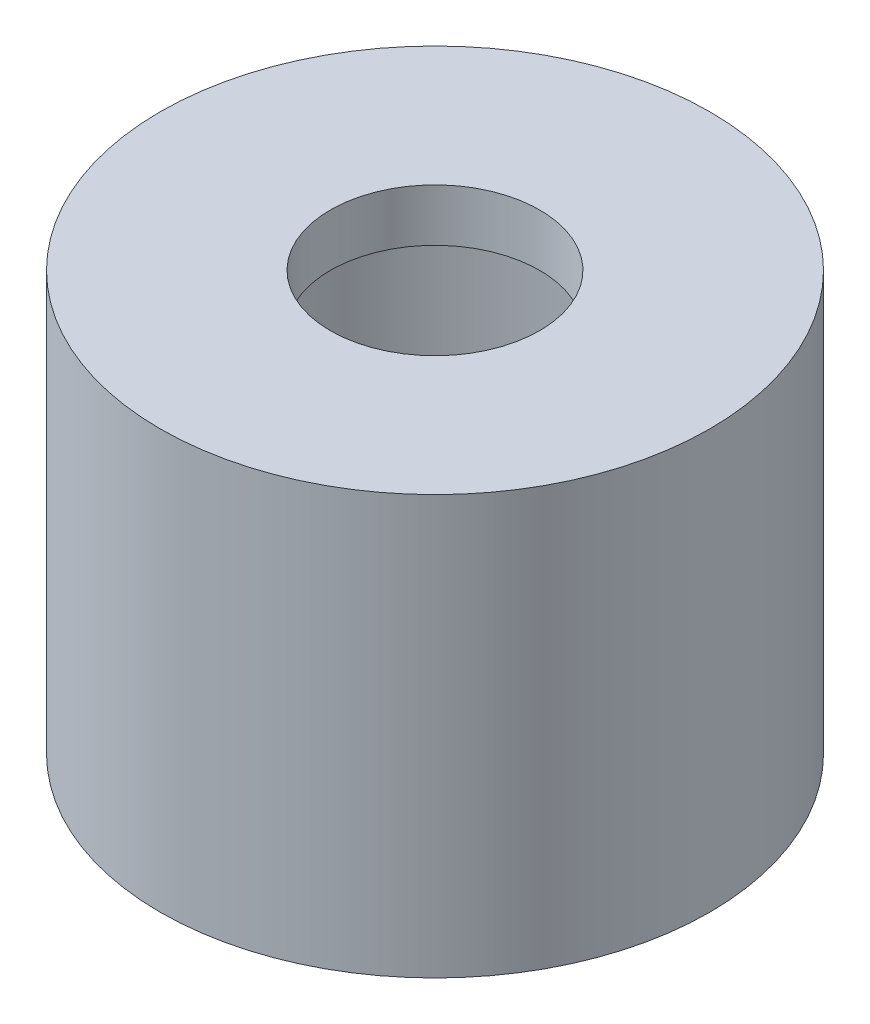
ISO-10303-21;
HEADER;
FILE_DESCRIPTION(('STEP AP214'),'2;1');
FILE_NAME('part.step','',(''),(''),'','','');
FILE_SCHEMA(('AUTOMOTIVE_DESIGN { 1 0 10303 214 1 1 1 1 }'));
ENDSEC;
DATA;
#1=APPLICATION_CONTEXT('core data for automotive mechanical design processes');
#2=APPLICATION_PROTOCOL_DEFINITION('international standard','automotive_design',2000,#1);
#3=PRODUCT_CONTEXT('',#1,'mechanical');
#4=PRODUCT('Part','Part','',(#3));
#5=PRODUCT_RELATED_PRODUCT_CATEGORY('part','',(#4));
#6=PRODUCT_DEFINITION_FORMATION('','',#4);
#7=PRODUCT_DEFINITION_CONTEXT('part definition',#1,'design');
#8=PRODUCT_DEFINITION('design','',#6,#7);
#9=PRODUCT_DEFINITION_SHAPE('','',#8);
#10=(LENGTH_UNIT() NAMED_UNIT(*) SI_UNIT(.MILLI.,.METRE.));
#11=(NAMED_UNIT(*) PLANE_ANGLE_UNIT() SI_UNIT($,.RADIAN.));
#12=(NAMED_UNIT(*) SI_UNIT($,.STERADIAN.) SOLID_ANGLE_UNIT());
#13=UNCERTAINTY_MEASURE_WITH_UNIT(LENGTH_MEASURE(1.E-05),#10,'distance_accuracy_value','');
#14=(GEOMETRIC_REPRESENTATION_CONTEXT(3) GLOBAL_UNCERTAINTY_ASSIGNED_CONTEXT((#13)) GLOBAL_UNIT_ASSIGNED_CONTEXT((#10,
#11,#12)) REPRESENTATION_CONTEXT('',''));
#15=CARTESIAN_POINT('',(0.,0.,0.));
#16=DIRECTION('',(0.,0.,1.));
#17=DIRECTION('',(1.,0.,0.));
#18=AXIS2_PLACEMENT_3D('',#15,#16,#17);
#19=CARTESIAN_POINT('',(0.,0.,0.));
#20=DIRECTION('',(0.,1.,0.));
#21=DIRECTION('',(0.,0.,1.));
#22=AXIS2_PLACEMENT_3D('',#19,#20,#21);
#23=CYLINDRICAL_SURFACE('',#22,10.5);
#24=CARTESIAN_POINT('',(0.,-19.,0.));
#25=DIRECTION('',(0.,1.,0.));
#26=DIRECTION('',(0.,0.,1.));
#27=AXIS2_PLACEMENT_3D('',#24,#25,#26);
#28=CIRCLE('',#27,10.5);
#29=CARTESIAN_POINT('',(0.,-19.,10.5));
#30=VERTEX_POINT('',#29);
#31=EDGE_CURVE('E10',#30,#30,#28,.T.);
#32=ORIENTED_EDGE('',*,*,#31,.T.);
#33=EDGE_LOOP('',(#32));
#34=FACE_BOUND('',#33,.T.);
#35=CARTESIAN_POINT('',(0.,-3.,0.));
#36=DIRECTION('',(0.,1.,0.));
#37=DIRECTION('',(0.,0.,1.));
#38=AXIS2_PLACEMENT_3D('',#35,#36,#37);
#39=CIRCLE('',#38,10.5);
#40=CARTESIAN_POINT('',(0.,-3.,10.5));
#41=VERTEX_POINT('',#40);
#42=EDGE_CURVE('E50',#41,#41,#39,.T.);
#43=ORIENTED_EDGE('',*,*,#42,.F.);
#44=EDGE_LOOP('',(#43));
#45=FACE_BOUND('',#44,.T.);
#46=ADVANCED_FACE('F28',(#34,#45),#23,.T.);
#47=CARTESIAN_POINT('',(-10.5,-19.,0.));
#48=DIRECTION('',(0.,-1.,0.));
#49=DIRECTION('',(0.,0.,-1.));
#50=AXIS2_PLACEMENT_3D('',#47,#48,#49);
#51=PLANE('',#50);
#52=CARTESIAN_POINT('',(0.,-19.,0.));
#53=DIRECTION('',(0.,1.,0.));
#54=DIRECTION('',(0.,0.,1.));
#55=AXIS2_PLACEMENT_3D('',#52,#53,#54);
#56=CIRCLE('',#55,8.5);
#57=CARTESIAN_POINT('',(0.,-19.,8.5));
#58=VERTEX_POINT('',#57);
#59=EDGE_CURVE('E34',#58,#58,#56,.T.);
#60=ORIENTED_EDGE('',*,*,#59,.T.);
#61=EDGE_LOOP('',(#60));
#62=FACE_BOUND('',#61,.T.);
#63=ORIENTED_EDGE('',*,*,#31,.F.);
#64=EDGE_LOOP('',(#63));
#65=FACE_BOUND('',#64,.T.);
#66=ADVANCED_FACE('F58',(#62,#65),#51,.T.);
#67=CARTESIAN_POINT('',(0.,0.,0.));
#68=DIRECTION('',(0.,1.,0.));
#69=DIRECTION('',(0.,0.,1.));
#70=AXIS2_PLACEMENT_3D('',#67,#68,#69);
#71=CYLINDRICAL_SURFACE('',#70,8.5);
#72=CARTESIAN_POINT('',(0.,-5.,0.));
#73=DIRECTION('',(0.,1.,0.));
#74=DIRECTION('',(0.,0.,1.));
#75=AXIS2_PLACEMENT_3D('',#72,#73,#74);
#76=CIRCLE('',#75,8.5);
#77=CARTESIAN_POINT('',(0.,-5.,8.5));
#78=VERTEX_POINT('',#77);
#79=EDGE_CURVE('E38',#78,#78,#76,.T.);
#80=ORIENTED_EDGE('',*,*,#79,.T.);
#81=EDGE_LOOP('',(#80));
#82=FACE_BOUND('',#81,.T.);
#83=ORIENTED_EDGE('',*,*,#59,.F.);
#84=EDGE_LOOP('',(#83));
#85=FACE_BOUND('',#84,.T.);
#86=ADVANCED_FACE('F62',(#82,#85),#71,.F.);
#87=CARTESIAN_POINT('',(-8.5,-5.,0.));
#88=DIRECTION('',(0.,-1.,0.));
#89=DIRECTION('',(0.,0.,-1.));
#90=AXIS2_PLACEMENT_3D('',#87,#88,#89);
#91=PLANE('',#90);
#92=CARTESIAN_POINT('',(0.,-5.,0.));
#93=DIRECTION('',(0.,1.,0.));
#94=DIRECTION('',(0.,0.,1.));
#95=AXIS2_PLACEMENT_3D('',#92,#93,#94);
#96=CIRCLE('',#95,4.);
#97=CARTESIAN_POINT('',(0.,-5.,4.));
#98=VERTEX_POINT('',#97);
#99=EDGE_CURVE('E42',#98,#98,#96,.T.);
#100=ORIENTED_EDGE('',*,*,#99,.T.);
#101=EDGE_LOOP('',(#100));
#102=FACE_BOUND('',#101,.T.);
#103=ORIENTED_EDGE('',*,*,#79,.F.);
#104=EDGE_LOOP('',(#103));
#105=FACE_BOUND('',#104,.T.);
#106=ADVANCED_FACE('F66',(#102,#105),#91,.T.);
#107=CARTESIAN_POINT('',(0.,0.,0.));
#108=DIRECTION('',(0.,1.,0.));
#109=DIRECTION('',(0.,0.,1.));
#110=AXIS2_PLACEMENT_3D('',#107,#108,#109);
#111=CYLINDRICAL_SURFACE('',#110,4.);
#112=CARTESIAN_POINT('',(0.,-3.,0.));
#113=DIRECTION('',(0.,1.,0.));
#114=DIRECTION('',(0.,0.,1.));
#115=AXIS2_PLACEMENT_3D('',#112,#113,#114);
#116=CIRCLE('',#115,4.);
#117=CARTESIAN_POINT('',(0.,-3.,4.));
#118=VERTEX_POINT('',#117);
#119=EDGE_CURVE('E47',#118,#118,#116,.T.);
#120=ORIENTED_EDGE('',*,*,#119,.T.);
#121=EDGE_LOOP('',(#120));
#122=FACE_BOUND('',#121,.T.);
#123=ORIENTED_EDGE('',*,*,#99,.F.);
#124=EDGE_LOOP('',(#123));
#125=FACE_BOUND('',#124,.T.);
#126=ADVANCED_FACE('F73',(#122,#125),#111,.F.);
#127=CARTESIAN_POINT('',(-10.5,-3.,0.));
#128=DIRECTION('',(0.,1.,0.));
#129=DIRECTION('',(0.,0.,1.));
#130=AXIS2_PLACEMENT_3D('',#127,#128,#129);
#131=PLANE('',#130);
#132=ORIENTED_EDGE('',*,*,#42,.T.);
#133=EDGE_LOOP('',(#132));
#134=FACE_BOUND('',#133,.T.);
#135=ORIENTED_EDGE('',*,*,#119,.F.);
#136=EDGE_LOOP('',(#135));
#137=FACE_BOUND('',#136,.T.);
#138=ADVANCED_FACE('F54',(#134,#137),#131,.T.);
#139=CLOSED_SHELL('',(#46,#66,#86,#106,#126,#138));
#140=MANIFOLD_SOLID_BREP('B2',#139);
#141=ADVANCED_BREP_SHAPE_REPRESENTATION('',(#18,#140),#14);
#142=SHAPE_DEFINITION_REPRESENTATION(#9,#141);
ENDSEC;
END-ISO-10303-21;
